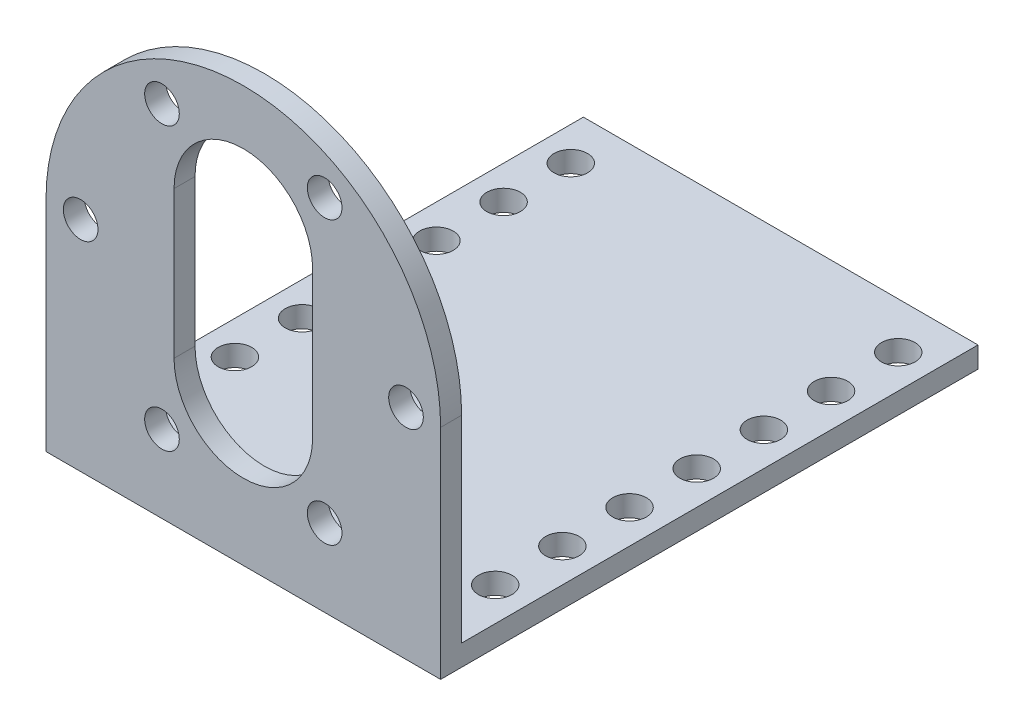
ISO-10303-21;
HEADER;
FILE_DESCRIPTION(('STEP AP214'),'2;1');
FILE_NAME('part.step','',(''),(''),'','','');
FILE_SCHEMA(('AUTOMOTIVE_DESIGN { 1 0 10303 214 1 1 1 1 }'));
ENDSEC;
DATA;
#1=APPLICATION_CONTEXT('core data for automotive mechanical design processes');
#2=APPLICATION_PROTOCOL_DEFINITION('international standard','automotive_design',2000,#1);
#3=PRODUCT_CONTEXT('',#1,'mechanical');
#4=PRODUCT('Part','Part','',(#3));
#5=PRODUCT_RELATED_PRODUCT_CATEGORY('part','',(#4));
#6=PRODUCT_DEFINITION_FORMATION('','',#4);
#7=PRODUCT_DEFINITION_CONTEXT('part definition',#1,'design');
#8=PRODUCT_DEFINITION('design','',#6,#7);
#9=PRODUCT_DEFINITION_SHAPE('','',#8);
#10=(LENGTH_UNIT() NAMED_UNIT(*) SI_UNIT(.MILLI.,.METRE.));
#11=(NAMED_UNIT(*) PLANE_ANGLE_UNIT() SI_UNIT($,.RADIAN.));
#12=(NAMED_UNIT(*) SI_UNIT($,.STERADIAN.) SOLID_ANGLE_UNIT());
#13=UNCERTAINTY_MEASURE_WITH_UNIT(LENGTH_MEASURE(1.E-05),#10,'distance_accuracy_value','');
#14=(GEOMETRIC_REPRESENTATION_CONTEXT(3) GLOBAL_UNCERTAINTY_ASSIGNED_CONTEXT((#13)) GLOBAL_UNIT_ASSIGNED_CONTEXT((#10,
#11,#12)) REPRESENTATION_CONTEXT('',''));
#15=CARTESIAN_POINT('',(0.,0.,0.));
#16=DIRECTION('',(0.,0.,1.));
#17=DIRECTION('',(1.,0.,0.));
#18=AXIS2_PLACEMENT_3D('',#15,#16,#17);
#19=CARTESIAN_POINT('',(-6.6,7.00000010430813,0.));
#20=DIRECTION('',(-1.,0.,0.));
#21=DIRECTION('',(0.,0.,1.));
#22=AXIS2_PLACEMENT_3D('',#19,#20,#21);
#23=PLANE('',#22);
#24=DIRECTION('',(0.,0.,1.));
#25=VECTOR('',#24,1.);
#26=CARTESIAN_POINT('',(-6.6,-7.00000010430813,0.));
#27=LINE('',#26,#25);
#28=CARTESIAN_POINT('',(-6.6,-7.00000010430813,2.));
#29=VERTEX_POINT('',#28);
#30=CARTESIAN_POINT('',(-6.6,-7.00000010430813,0.));
#31=VERTEX_POINT('',#30);
#32=EDGE_CURVE('E109',#29,#31,#27,.F.);
#33=ORIENTED_EDGE('',*,*,#32,.T.);
#34=DIRECTION('',(0.,1.,0.));
#35=VECTOR('',#34,1.);
#36=CARTESIAN_POINT('',(-6.6,-1.,0.));
#37=LINE('',#36,#35);
#38=CARTESIAN_POINT('',(-6.6,7.00000010430813,0.));
#39=VERTEX_POINT('',#38);
#40=EDGE_CURVE('E117',#31,#39,#37,.T.);
#41=ORIENTED_EDGE('',*,*,#40,.T.);
#42=DIRECTION('',(0.,0.,1.));
#43=VECTOR('',#42,1.);
#44=CARTESIAN_POINT('',(-6.6,7.00000010430813,0.));
#45=LINE('',#44,#43);
#46=CARTESIAN_POINT('',(-6.6,7.00000010430813,2.));
#47=VERTEX_POINT('',#46);
#48=EDGE_CURVE('E91',#39,#47,#45,.T.);
#49=ORIENTED_EDGE('',*,*,#48,.T.);
#50=DIRECTION('',(0.,1.,0.));
#51=VECTOR('',#50,1.);
#52=CARTESIAN_POINT('',(-6.6,-1.,2.));
#53=LINE('',#52,#51);
#54=EDGE_CURVE('E265',#29,#47,#53,.T.);
#55=ORIENTED_EDGE('',*,*,#54,.F.);
#56=EDGE_LOOP('',(#33,#41,#49,#55));
#57=FACE_BOUND('',#56,.T.);
#58=ADVANCED_FACE('F17',(#57),#23,.F.);
#59=CARTESIAN_POINT('',(0.,7.00000010430813,0.));
#60=DIRECTION('',(0.,0.,1.));
#61=DIRECTION('',(1.,0.,0.));
#62=AXIS2_PLACEMENT_3D('',#59,#60,#61);
#63=CYLINDRICAL_SURFACE('',#62,6.6);
#64=ORIENTED_EDGE('',*,*,#48,.F.);
#65=CARTESIAN_POINT('',(0.,7.00000010430813,0.));
#66=DIRECTION('',(0.,0.,1.));
#67=DIRECTION('',(1.,0.,0.));
#68=AXIS2_PLACEMENT_3D('',#65,#66,#67);
#69=CIRCLE('',#68,6.6);
#70=CARTESIAN_POINT('',(6.6,7.00000010430813,0.));
#71=VERTEX_POINT('',#70);
#72=EDGE_CURVE('E20',#39,#71,#69,.F.);
#73=ORIENTED_EDGE('',*,*,#72,.T.);
#74=DIRECTION('',(0.,0.,-1.));
#75=VECTOR('',#74,1.);
#76=CARTESIAN_POINT('',(6.6,7.00000010430813,0.));
#77=LINE('',#76,#75);
#78=CARTESIAN_POINT('',(6.6,7.00000010430813,2.));
#79=VERTEX_POINT('',#78);
#80=EDGE_CURVE('E96',#71,#79,#77,.F.);
#81=ORIENTED_EDGE('',*,*,#80,.T.);
#82=CARTESIAN_POINT('',(0.,7.00000010430813,2.));
#83=DIRECTION('',(0.,0.,1.));
#84=DIRECTION('',(1.,0.,0.));
#85=AXIS2_PLACEMENT_3D('',#82,#83,#84);
#86=CIRCLE('',#85,6.6);
#87=EDGE_CURVE('E263',#47,#79,#86,.F.);
#88=ORIENTED_EDGE('',*,*,#87,.F.);
#89=EDGE_LOOP('',(#64,#73,#81,#88));
#90=FACE_BOUND('',#89,.T.);
#91=ADVANCED_FACE('F95',(#90),#63,.F.);
#92=CARTESIAN_POINT('',(6.6,-7.00000010430813,0.));
#93=DIRECTION('',(1.,0.,0.));
#94=DIRECTION('',(0.,0.,-1.));
#95=AXIS2_PLACEMENT_3D('',#92,#93,#94);
#96=PLANE('',#95);
#97=ORIENTED_EDGE('',*,*,#80,.F.);
#98=DIRECTION('',(0.,1.,0.));
#99=VECTOR('',#98,1.);
#100=CARTESIAN_POINT('',(6.6,-1.,0.));
#101=LINE('',#100,#99);
#102=CARTESIAN_POINT('',(6.6,-7.00000010430813,0.));
#103=VERTEX_POINT('',#102);
#104=EDGE_CURVE('E101',#71,#103,#101,.F.);
#105=ORIENTED_EDGE('',*,*,#104,.T.);
#106=DIRECTION('',(0.,0.,1.));
#107=VECTOR('',#106,1.);
#108=CARTESIAN_POINT('',(6.6,-7.00000010430813,0.));
#109=LINE('',#108,#107);
#110=CARTESIAN_POINT('',(6.6,-7.00000010430813,2.));
#111=VERTEX_POINT('',#110);
#112=EDGE_CURVE('E102',#103,#111,#109,.T.);
#113=ORIENTED_EDGE('',*,*,#112,.T.);
#114=DIRECTION('',(0.,1.,0.));
#115=VECTOR('',#114,1.);
#116=CARTESIAN_POINT('',(6.6,-1.,2.));
#117=LINE('',#116,#115);
#118=EDGE_CURVE('E107',#79,#111,#117,.F.);
#119=ORIENTED_EDGE('',*,*,#118,.F.);
#120=EDGE_LOOP('',(#97,#105,#113,#119));
#121=FACE_BOUND('',#120,.T.);
#122=ADVANCED_FACE('F104',(#121),#96,.F.);
#123=CARTESIAN_POINT('',(0.,-7.00000010430813,0.));
#124=DIRECTION('',(0.,0.,1.));
#125=DIRECTION('',(1.,0.,0.));
#126=AXIS2_PLACEMENT_3D('',#123,#124,#125);
#127=CYLINDRICAL_SURFACE('',#126,6.6);
#128=ORIENTED_EDGE('',*,*,#112,.F.);
#129=CARTESIAN_POINT('',(0.,-7.00000010430813,0.));
#130=DIRECTION('',(0.,0.,1.));
#131=DIRECTION('',(1.,0.,0.));
#132=AXIS2_PLACEMENT_3D('',#129,#130,#131);
#133=CIRCLE('',#132,6.6);
#134=EDGE_CURVE('E115',#103,#31,#133,.F.);
#135=ORIENTED_EDGE('',*,*,#134,.T.);
#136=ORIENTED_EDGE('',*,*,#32,.F.);
#137=CARTESIAN_POINT('',(0.,-7.00000010430813,2.));
#138=DIRECTION('',(0.,0.,1.));
#139=DIRECTION('',(1.,0.,0.));
#140=AXIS2_PLACEMENT_3D('',#137,#138,#139);
#141=CIRCLE('',#140,6.6);
#142=EDGE_CURVE('E260',#111,#29,#141,.F.);
#143=ORIENTED_EDGE('',*,*,#142,.F.);
#144=EDGE_LOOP('',(#128,#135,#136,#143));
#145=FACE_BOUND('',#144,.T.);
#146=ADVANCED_FACE('F294',(#145),#127,.F.);
#147=CARTESIAN_POINT('',(7.75,13.4233937586588,0.));
#148=DIRECTION('',(0.,0.,1.));
#149=DIRECTION('',(1.,0.,0.));
#150=AXIS2_PLACEMENT_3D('',#147,#148,#149);
#151=CYLINDRICAL_SURFACE('',#150,1.65);
#152=CARTESIAN_POINT('',(7.75,13.4233937586588,0.));
#153=DIRECTION('',(0.,0.,1.));
#154=DIRECTION('',(1.,0.,0.));
#155=AXIS2_PLACEMENT_3D('',#152,#153,#154);
#156=CIRCLE('',#155,1.65);
#157=CARTESIAN_POINT('',(9.4,13.4233937586588,0.));
#158=VERTEX_POINT('',#157);
#159=EDGE_CURVE('E270',#158,#158,#156,.F.);
#160=ORIENTED_EDGE('',*,*,#159,.T.);
#161=EDGE_LOOP('',(#160));
#162=FACE_BOUND('',#161,.T.);
#163=CARTESIAN_POINT('',(7.75,13.4233937586588,2.));
#164=DIRECTION('',(0.,0.,1.));
#165=DIRECTION('',(1.,0.,0.));
#166=AXIS2_PLACEMENT_3D('',#163,#164,#165);
#167=CIRCLE('',#166,1.65);
#168=CARTESIAN_POINT('',(9.4,13.4233937586588,2.));
#169=VERTEX_POINT('',#168);
#170=EDGE_CURVE('E257',#169,#169,#167,.F.);
#171=ORIENTED_EDGE('',*,*,#170,.F.);
#172=EDGE_LOOP('',(#171));
#173=FACE_BOUND('',#172,.T.);
#174=ADVANCED_FACE('F454',(#162,#173),#151,.F.);
#175=CARTESIAN_POINT('',(15.5,0.,0.));
#176=DIRECTION('',(0.,0.,1.));
#177=DIRECTION('',(1.,0.,0.));
#178=AXIS2_PLACEMENT_3D('',#175,#176,#177);
#179=CYLINDRICAL_SURFACE('',#178,1.65);
#180=CARTESIAN_POINT('',(15.5,0.,0.));
#181=DIRECTION('',(0.,0.,1.));
#182=DIRECTION('',(1.,0.,0.));
#183=AXIS2_PLACEMENT_3D('',#180,#181,#182);
#184=CIRCLE('',#183,1.65);
#185=CARTESIAN_POINT('',(17.15,0.,0.));
#186=VERTEX_POINT('',#185);
#187=EDGE_CURVE('E273',#186,#186,#184,.F.);
#188=ORIENTED_EDGE('',*,*,#187,.T.);
#189=EDGE_LOOP('',(#188));
#190=FACE_BOUND('',#189,.T.);
#191=CARTESIAN_POINT('',(15.5,0.,2.));
#192=DIRECTION('',(0.,0.,1.));
#193=DIRECTION('',(1.,0.,0.));
#194=AXIS2_PLACEMENT_3D('',#191,#192,#193);
#195=CIRCLE('',#194,1.65);
#196=CARTESIAN_POINT('',(17.15,0.,2.));
#197=VERTEX_POINT('',#196);
#198=EDGE_CURVE('E254',#197,#197,#195,.F.);
#199=ORIENTED_EDGE('',*,*,#198,.F.);
#200=EDGE_LOOP('',(#199));
#201=FACE_BOUND('',#200,.T.);
#202=ADVANCED_FACE('F450',(#190,#201),#179,.F.);
#203=CARTESIAN_POINT('',(-7.75,-13.4233937586588,0.));
#204=DIRECTION('',(0.,0.,1.));
#205=DIRECTION('',(1.,0.,0.));
#206=AXIS2_PLACEMENT_3D('',#203,#204,#205);
#207=CYLINDRICAL_SURFACE('',#206,1.65);
#208=CARTESIAN_POINT('',(-7.75,-13.4233937586588,0.));
#209=DIRECTION('',(0.,0.,1.));
#210=DIRECTION('',(1.,0.,0.));
#211=AXIS2_PLACEMENT_3D('',#208,#209,#210);
#212=CIRCLE('',#211,1.65);
#213=CARTESIAN_POINT('',(-6.1,-13.4233937586588,0.));
#214=VERTEX_POINT('',#213);
#215=EDGE_CURVE('E276',#214,#214,#212,.F.);
#216=ORIENTED_EDGE('',*,*,#215,.T.);
#217=EDGE_LOOP('',(#216));
#218=FACE_BOUND('',#217,.T.);
#219=CARTESIAN_POINT('',(-7.75,-13.4233937586588,2.));
#220=DIRECTION('',(0.,0.,1.));
#221=DIRECTION('',(1.,0.,0.));
#222=AXIS2_PLACEMENT_3D('',#219,#220,#221);
#223=CIRCLE('',#222,1.65);
#224=CARTESIAN_POINT('',(-6.1,-13.4233937586588,2.));
#225=VERTEX_POINT('',#224);
#226=EDGE_CURVE('E251',#225,#225,#223,.F.);
#227=ORIENTED_EDGE('',*,*,#226,.F.);
#228=EDGE_LOOP('',(#227));
#229=FACE_BOUND('',#228,.T.);
#230=ADVANCED_FACE('F446',(#218,#229),#207,.F.);
#231=CARTESIAN_POINT('',(-7.75,13.4233937586588,0.));
#232=DIRECTION('',(0.,0.,1.));
#233=DIRECTION('',(1.,0.,0.));
#234=AXIS2_PLACEMENT_3D('',#231,#232,#233);
#235=CYLINDRICAL_SURFACE('',#234,1.65);
#236=CARTESIAN_POINT('',(-7.75,13.4233937586588,0.));
#237=DIRECTION('',(0.,0.,1.));
#238=DIRECTION('',(1.,0.,0.));
#239=AXIS2_PLACEMENT_3D('',#236,#237,#238);
#240=CIRCLE('',#239,1.65);
#241=CARTESIAN_POINT('',(-6.1,13.4233937586588,0.));
#242=VERTEX_POINT('',#241);
#243=EDGE_CURVE('E279',#242,#242,#240,.F.);
#244=ORIENTED_EDGE('',*,*,#243,.T.);
#245=EDGE_LOOP('',(#244));
#246=FACE_BOUND('',#245,.T.);
#247=CARTESIAN_POINT('',(-7.75,13.4233937586588,2.));
#248=DIRECTION('',(0.,0.,1.));
#249=DIRECTION('',(1.,0.,0.));
#250=AXIS2_PLACEMENT_3D('',#247,#248,#249);
#251=CIRCLE('',#250,1.65);
#252=CARTESIAN_POINT('',(-6.1,13.4233937586588,2.));
#253=VERTEX_POINT('',#252);
#254=EDGE_CURVE('E248',#253,#253,#251,.F.);
#255=ORIENTED_EDGE('',*,*,#254,.F.);
#256=EDGE_LOOP('',(#255));
#257=FACE_BOUND('',#256,.T.);
#258=ADVANCED_FACE('F442',(#246,#257),#235,.F.);
#259=CARTESIAN_POINT('',(-15.5,0.,0.));
#260=DIRECTION('',(0.,0.,1.));
#261=DIRECTION('',(1.,0.,0.));
#262=AXIS2_PLACEMENT_3D('',#259,#260,#261);
#263=CYLINDRICAL_SURFACE('',#262,1.65);
#264=CARTESIAN_POINT('',(-15.5,0.,0.));
#265=DIRECTION('',(0.,0.,1.));
#266=DIRECTION('',(1.,0.,0.));
#267=AXIS2_PLACEMENT_3D('',#264,#265,#266);
#268=CIRCLE('',#267,1.65);
#269=CARTESIAN_POINT('',(-13.85,0.,0.));
#270=VERTEX_POINT('',#269);
#271=EDGE_CURVE('E282',#270,#270,#268,.F.);
#272=ORIENTED_EDGE('',*,*,#271,.T.);
#273=EDGE_LOOP('',(#272));
#274=FACE_BOUND('',#273,.T.);
#275=CARTESIAN_POINT('',(-15.5,0.,2.));
#276=DIRECTION('',(0.,0.,1.));
#277=DIRECTION('',(1.,0.,0.));
#278=AXIS2_PLACEMENT_3D('',#275,#276,#277);
#279=CIRCLE('',#278,1.65);
#280=CARTESIAN_POINT('',(-13.85,0.,2.));
#281=VERTEX_POINT('',#280);
#282=EDGE_CURVE('E245',#281,#281,#279,.F.);
#283=ORIENTED_EDGE('',*,*,#282,.F.);
#284=EDGE_LOOP('',(#283));
#285=FACE_BOUND('',#284,.T.);
#286=ADVANCED_FACE('F435',(#274,#285),#263,.F.);
#287=CARTESIAN_POINT('',(7.74999999999999,-13.4233937586588,0.));
#288=DIRECTION('',(0.,0.,1.));
#289=DIRECTION('',(1.,0.,0.));
#290=AXIS2_PLACEMENT_3D('',#287,#288,#289);
#291=CYLINDRICAL_SURFACE('',#290,1.65);
#292=CARTESIAN_POINT('',(7.74999999999999,-13.4233937586588,0.));
#293=DIRECTION('',(0.,0.,1.));
#294=DIRECTION('',(1.,0.,0.));
#295=AXIS2_PLACEMENT_3D('',#292,#293,#294);
#296=CIRCLE('',#295,1.65);
#297=CARTESIAN_POINT('',(9.39999999999999,-13.4233937586588,0.));
#298=VERTEX_POINT('',#297);
#299=EDGE_CURVE('E285',#298,#298,#296,.F.);
#300=ORIENTED_EDGE('',*,*,#299,.T.);
#301=EDGE_LOOP('',(#300));
#302=FACE_BOUND('',#301,.T.);
#303=CARTESIAN_POINT('',(7.74999999999999,-13.4233937586588,2.));
#304=DIRECTION('',(0.,0.,1.));
#305=DIRECTION('',(1.,0.,0.));
#306=AXIS2_PLACEMENT_3D('',#303,#304,#305);
#307=CIRCLE('',#306,1.65);
#308=CARTESIAN_POINT('',(9.39999999999999,-13.4233937586588,2.));
#309=VERTEX_POINT('',#308);
#310=EDGE_CURVE('E125',#309,#309,#307,.F.);
#311=ORIENTED_EDGE('',*,*,#310,.F.);
#312=EDGE_LOOP('',(#311));
#313=FACE_BOUND('',#312,.T.);
#314=ADVANCED_FACE('F427',(#302,#313),#291,.F.);
#315=CARTESIAN_POINT('',(0.,-1.,0.));
#316=DIRECTION('',(0.,0.,1.));
#317=DIRECTION('',(1.,0.,0.));
#318=AXIS2_PLACEMENT_3D('',#315,#316,#317);
#319=PLANE('',#318);
#320=ORIENTED_EDGE('',*,*,#159,.F.);
#321=EDGE_LOOP('',(#320));
#322=FACE_BOUND('',#321,.T.);
#323=ORIENTED_EDGE('',*,*,#187,.F.);
#324=EDGE_LOOP('',(#323));
#325=FACE_BOUND('',#324,.T.);
#326=ORIENTED_EDGE('',*,*,#215,.F.);
#327=EDGE_LOOP('',(#326));
#328=FACE_BOUND('',#327,.T.);
#329=ORIENTED_EDGE('',*,*,#243,.F.);
#330=EDGE_LOOP('',(#329));
#331=FACE_BOUND('',#330,.T.);
#332=ORIENTED_EDGE('',*,*,#271,.F.);
#333=EDGE_LOOP('',(#332));
#334=FACE_BOUND('',#333,.T.);
#335=ORIENTED_EDGE('',*,*,#299,.F.);
#336=EDGE_LOOP('',(#335));
#337=FACE_BOUND('',#336,.T.);
#338=ORIENTED_EDGE('',*,*,#134,.F.);
#339=ORIENTED_EDGE('',*,*,#104,.F.);
#340=ORIENTED_EDGE('',*,*,#72,.F.);
#341=ORIENTED_EDGE('',*,*,#40,.F.);
#342=EDGE_LOOP('',(#338,#339,#340,#341));
#343=FACE_BOUND('',#342,.T.);
#344=DIRECTION('',(0.,1.,0.));
#345=VECTOR('',#344,1.);
#346=CARTESIAN_POINT('',(-18.8,0.,0.));
#347=LINE('',#346,#345);
#348=CARTESIAN_POINT('',(-18.8,0.,0.));
#349=VERTEX_POINT('',#348);
#350=CARTESIAN_POINT('',(-18.8,-18.8,0.));
#351=VERTEX_POINT('',#350);
#352=EDGE_CURVE('E121',#349,#351,#347,.F.);
#353=ORIENTED_EDGE('',*,*,#352,.F.);
#354=CARTESIAN_POINT('',(0.,0.,0.));
#355=DIRECTION('',(0.,0.,1.));
#356=DIRECTION('',(1.,0.,0.));
#357=AXIS2_PLACEMENT_3D('',#354,#355,#356);
#358=CIRCLE('',#357,18.8);
#359=CARTESIAN_POINT('',(18.8,0.,0.));
#360=VERTEX_POINT('',#359);
#361=EDGE_CURVE('E136',#360,#349,#358,.T.);
#362=ORIENTED_EDGE('',*,*,#361,.F.);
#363=DIRECTION('',(0.,1.,0.));
#364=VECTOR('',#363,1.);
#365=CARTESIAN_POINT('',(18.8,-20.8,0.));
#366=LINE('',#365,#364);
#367=CARTESIAN_POINT('',(18.8,-18.8,0.));
#368=VERTEX_POINT('',#367);
#369=EDGE_CURVE('E135',#368,#360,#366,.T.);
#370=ORIENTED_EDGE('',*,*,#369,.F.);
#371=DIRECTION('',(1.,0.,0.));
#372=VECTOR('',#371,1.);
#373=CARTESIAN_POINT('',(-18.8,-18.8,0.));
#374=LINE('',#373,#372);
#375=EDGE_CURVE('E132',#351,#368,#374,.T.);
#376=ORIENTED_EDGE('',*,*,#375,.F.);
#377=EDGE_LOOP('',(#353,#362,#370,#376));
#378=FACE_BOUND('',#377,.T.);
#379=ADVANCED_FACE('F112',(#322,#325,#328,#331,#334,#337,#343,#378),#319,.F.);
#380=CARTESIAN_POINT('',(0.,0.,0.));
#381=DIRECTION('',(0.,0.,1.));
#382=DIRECTION('',(1.,0.,0.));
#383=AXIS2_PLACEMENT_3D('',#380,#381,#382);
#384=CYLINDRICAL_SURFACE('',#383,18.8);
#385=CARTESIAN_POINT('',(0.,0.,2.));
#386=DIRECTION('',(0.,0.,1.));
#387=DIRECTION('',(1.,0.,0.));
#388=AXIS2_PLACEMENT_3D('',#385,#386,#387);
#389=CIRCLE('',#388,18.8);
#390=CARTESIAN_POINT('',(18.8,0.,2.));
#391=VERTEX_POINT('',#390);
#392=CARTESIAN_POINT('',(-18.8,0.,2.));
#393=VERTEX_POINT('',#392);
#394=EDGE_CURVE('E159',#391,#393,#389,.T.);
#395=ORIENTED_EDGE('',*,*,#394,.F.);
#396=DIRECTION('',(0.,0.,-1.));
#397=VECTOR('',#396,1.);
#398=CARTESIAN_POINT('',(18.8,0.,0.));
#399=LINE('',#398,#397);
#400=EDGE_CURVE('E142',#360,#391,#399,.F.);
#401=ORIENTED_EDGE('',*,*,#400,.F.);
#402=ORIENTED_EDGE('',*,*,#361,.T.);
#403=DIRECTION('',(0.,0.,1.));
#404=VECTOR('',#403,1.);
#405=CARTESIAN_POINT('',(-18.8,0.,0.));
#406=LINE('',#405,#404);
#407=EDGE_CURVE('E307',#393,#349,#406,.F.);
#408=ORIENTED_EDGE('',*,*,#407,.F.);
#409=EDGE_LOOP('',(#395,#401,#402,#408));
#410=FACE_BOUND('',#409,.T.);
#411=ADVANCED_FACE('F412',(#410),#384,.T.);
#412=CARTESIAN_POINT('',(-18.8,-18.8,0.));
#413=DIRECTION('',(0.,1.,0.));
#414=DIRECTION('',(0.,0.,1.));
#415=AXIS2_PLACEMENT_3D('',#412,#413,#414);
#416=PLANE('',#415);
#417=CARTESIAN_POINT('',(15.6,-18.8,-6.4));
#418=DIRECTION('',(0.,1.,0.));
#419=DIRECTION('',(0.,0.,1.));
#420=AXIS2_PLACEMENT_3D('',#417,#418,#419);
#421=CIRCLE('',#420,1.6);
#422=CARTESIAN_POINT('',(15.6,-18.8,-4.8));
#423=VERTEX_POINT('',#422);
#424=EDGE_CURVE('E150',#423,#423,#421,.F.);
#425=ORIENTED_EDGE('',*,*,#424,.T.);
#426=EDGE_LOOP('',(#425));
#427=FACE_BOUND('',#426,.T.);
#428=CARTESIAN_POINT('',(15.6,-18.8,-32.));
#429=DIRECTION('',(0.,1.,0.));
#430=DIRECTION('',(0.,0.,1.));
#431=AXIS2_PLACEMENT_3D('',#428,#429,#430);
#432=CIRCLE('',#431,1.6);
#433=CARTESIAN_POINT('',(15.6,-18.8,-30.4));
#434=VERTEX_POINT('',#433);
#435=EDGE_CURVE('E203',#434,#434,#432,.F.);
#436=ORIENTED_EDGE('',*,*,#435,.T.);
#437=EDGE_LOOP('',(#436));
#438=FACE_BOUND('',#437,.T.);
#439=CARTESIAN_POINT('',(-15.6,-18.8,-38.4));
#440=DIRECTION('',(0.,1.,0.));
#441=DIRECTION('',(0.,0.,1.));
#442=AXIS2_PLACEMENT_3D('',#439,#440,#441);
#443=CIRCLE('',#442,1.6);
#444=CARTESIAN_POINT('',(-15.6,-18.8,-36.8));
#445=VERTEX_POINT('',#444);
#446=EDGE_CURVE('E206',#445,#445,#443,.F.);
#447=ORIENTED_EDGE('',*,*,#446,.T.);
#448=EDGE_LOOP('',(#447));
#449=FACE_BOUND('',#448,.T.);
#450=CARTESIAN_POINT('',(-15.6,-18.8,-12.8));
#451=DIRECTION('',(0.,1.,0.));
#452=DIRECTION('',(0.,0.,1.));
#453=AXIS2_PLACEMENT_3D('',#450,#451,#452);
#454=CIRCLE('',#453,1.6);
#455=CARTESIAN_POINT('',(-15.6,-18.8,-11.2));
#456=VERTEX_POINT('',#455);
#457=EDGE_CURVE('E209',#456,#456,#454,.F.);
#458=ORIENTED_EDGE('',*,*,#457,.T.);
#459=EDGE_LOOP('',(#458));
#460=FACE_BOUND('',#459,.T.);
#461=CARTESIAN_POINT('',(-15.6,-18.8,-19.2));
#462=DIRECTION('',(0.,1.,0.));
#463=DIRECTION('',(0.,0.,1.));
#464=AXIS2_PLACEMENT_3D('',#461,#462,#463);
#465=CIRCLE('',#464,1.6);
#466=CARTESIAN_POINT('',(-15.6,-18.8,-17.6));
#467=VERTEX_POINT('',#466);
#468=EDGE_CURVE('E212',#467,#467,#465,.F.);
#469=ORIENTED_EDGE('',*,*,#468,.T.);
#470=EDGE_LOOP('',(#469));
#471=FACE_BOUND('',#470,.T.);
#472=CARTESIAN_POINT('',(-15.6,-18.8,-44.8));
#473=DIRECTION('',(0.,1.,0.));
#474=DIRECTION('',(0.,0.,1.));
#475=AXIS2_PLACEMENT_3D('',#472,#473,#474);
#476=CIRCLE('',#475,1.6);
#477=CARTESIAN_POINT('',(-15.6,-18.8,-43.2));
#478=VERTEX_POINT('',#477);
#479=EDGE_CURVE('E215',#478,#478,#476,.F.);
#480=ORIENTED_EDGE('',*,*,#479,.T.);
#481=EDGE_LOOP('',(#480));
#482=FACE_BOUND('',#481,.T.);
#483=CARTESIAN_POINT('',(15.6,-18.8,-25.6));
#484=DIRECTION('',(0.,1.,0.));
#485=DIRECTION('',(0.,0.,1.));
#486=AXIS2_PLACEMENT_3D('',#483,#484,#485);
#487=CIRCLE('',#486,1.6);
#488=CARTESIAN_POINT('',(15.6,-18.8,-24.));
#489=VERTEX_POINT('',#488);
#490=EDGE_CURVE('E218',#489,#489,#487,.F.);
#491=ORIENTED_EDGE('',*,*,#490,.T.);
#492=EDGE_LOOP('',(#491));
#493=FACE_BOUND('',#492,.T.);
#494=CARTESIAN_POINT('',(15.6,-18.8,-12.8));
#495=DIRECTION('',(0.,1.,0.));
#496=DIRECTION('',(0.,0.,1.));
#497=AXIS2_PLACEMENT_3D('',#494,#495,#496);
#498=CIRCLE('',#497,1.6);
#499=CARTESIAN_POINT('',(15.6,-18.8,-11.2));
#500=VERTEX_POINT('',#499);
#501=EDGE_CURVE('E221',#500,#500,#498,.F.);
#502=ORIENTED_EDGE('',*,*,#501,.T.);
#503=EDGE_LOOP('',(#502));
#504=FACE_BOUND('',#503,.T.);
#505=CARTESIAN_POINT('',(15.6,-18.8,-38.4));
#506=DIRECTION('',(0.,1.,0.));
#507=DIRECTION('',(0.,0.,1.));
#508=AXIS2_PLACEMENT_3D('',#505,#506,#507);
#509=CIRCLE('',#508,1.6);
#510=CARTESIAN_POINT('',(15.6,-18.8,-36.8));
#511=VERTEX_POINT('',#510);
#512=EDGE_CURVE('E224',#511,#511,#509,.F.);
#513=ORIENTED_EDGE('',*,*,#512,.T.);
#514=EDGE_LOOP('',(#513));
#515=FACE_BOUND('',#514,.T.);
#516=CARTESIAN_POINT('',(-15.6,-18.8,-32.));
#517=DIRECTION('',(0.,1.,0.));
#518=DIRECTION('',(0.,0.,1.));
#519=AXIS2_PLACEMENT_3D('',#516,#517,#518);
#520=CIRCLE('',#519,1.6);
#521=CARTESIAN_POINT('',(-15.6,-18.8,-30.4));
#522=VERTEX_POINT('',#521);
#523=EDGE_CURVE('E227',#522,#522,#520,.F.);
#524=ORIENTED_EDGE('',*,*,#523,.T.);
#525=EDGE_LOOP('',(#524));
#526=FACE_BOUND('',#525,.T.);
#527=CARTESIAN_POINT('',(-15.6,-18.8,-6.4));
#528=DIRECTION('',(0.,1.,0.));
#529=DIRECTION('',(0.,0.,1.));
#530=AXIS2_PLACEMENT_3D('',#527,#528,#529);
#531=CIRCLE('',#530,1.6);
#532=CARTESIAN_POINT('',(-15.6,-18.8,-4.8));
#533=VERTEX_POINT('',#532);
#534=EDGE_CURVE('E230',#533,#533,#531,.F.);
#535=ORIENTED_EDGE('',*,*,#534,.T.);
#536=EDGE_LOOP('',(#535));
#537=FACE_BOUND('',#536,.T.);
#538=CARTESIAN_POINT('',(-15.6,-18.8,-25.6));
#539=DIRECTION('',(0.,1.,0.));
#540=DIRECTION('',(0.,0.,1.));
#541=AXIS2_PLACEMENT_3D('',#538,#539,#540);
#542=CIRCLE('',#541,1.6);
#543=CARTESIAN_POINT('',(-15.6,-18.8,-24.));
#544=VERTEX_POINT('',#543);
#545=EDGE_CURVE('E233',#544,#544,#542,.F.);
#546=ORIENTED_EDGE('',*,*,#545,.T.);
#547=EDGE_LOOP('',(#546));
#548=FACE_BOUND('',#547,.T.);
#549=CARTESIAN_POINT('',(15.6,-18.8,-44.8));
#550=DIRECTION('',(0.,1.,0.));
#551=DIRECTION('',(0.,0.,1.));
#552=AXIS2_PLACEMENT_3D('',#549,#550,#551);
#553=CIRCLE('',#552,1.6);
#554=CARTESIAN_POINT('',(15.6,-18.8,-43.2));
#555=VERTEX_POINT('',#554);
#556=EDGE_CURVE('E236',#555,#555,#553,.F.);
#557=ORIENTED_EDGE('',*,*,#556,.T.);
#558=EDGE_LOOP('',(#557));
#559=FACE_BOUND('',#558,.T.);
#560=CARTESIAN_POINT('',(15.6,-18.8,-19.2));
#561=DIRECTION('',(0.,1.,0.));
#562=DIRECTION('',(0.,0.,1.));
#563=AXIS2_PLACEMENT_3D('',#560,#561,#562);
#564=CIRCLE('',#563,1.6);
#565=CARTESIAN_POINT('',(15.6,-18.8,-17.6));
#566=VERTEX_POINT('',#565);
#567=EDGE_CURVE('E239',#566,#566,#564,.F.);
#568=ORIENTED_EDGE('',*,*,#567,.T.);
#569=EDGE_LOOP('',(#568));
#570=FACE_BOUND('',#569,.T.);
#571=DIRECTION('',(-1.,0.,0.));
#572=VECTOR('',#571,1.);
#573=CARTESIAN_POINT('',(0.,-18.8,-49.2));
#574=LINE('',#573,#572);
#575=CARTESIAN_POINT('',(-18.8,-18.8,-49.2));
#576=VERTEX_POINT('',#575);
#577=CARTESIAN_POINT('',(18.8,-18.8,-49.2));
#578=VERTEX_POINT('',#577);
#579=EDGE_CURVE('E418',#576,#578,#574,.F.);
#580=ORIENTED_EDGE('',*,*,#579,.F.);
#581=DIRECTION('',(0.,0.,1.));
#582=VECTOR('',#581,1.);
#583=CARTESIAN_POINT('',(-18.8,-18.8,0.));
#584=LINE('',#583,#582);
#585=EDGE_CURVE('E124',#351,#576,#584,.F.);
#586=ORIENTED_EDGE('',*,*,#585,.F.);
#587=ORIENTED_EDGE('',*,*,#375,.T.);
#588=DIRECTION('',(0.,0.,-1.));
#589=VECTOR('',#588,1.);
#590=CARTESIAN_POINT('',(18.8,-18.8,0.));
#591=LINE('',#590,#589);
#592=EDGE_CURVE('E145',#578,#368,#591,.F.);
#593=ORIENTED_EDGE('',*,*,#592,.F.);
#594=EDGE_LOOP('',(#580,#586,#587,#593));
#595=FACE_BOUND('',#594,.T.);
#596=ADVANCED_FACE('F409',(#427,#438,#449,#460,#471,#482,#493,#504,#515,#526,#537,#548,#559,
#570,#595),#416,.T.);
#597=CARTESIAN_POINT('',(18.8,-20.8,0.));
#598=DIRECTION('',(1.,0.,0.));
#599=DIRECTION('',(0.,0.,-1.));
#600=AXIS2_PLACEMENT_3D('',#597,#598,#599);
#601=PLANE('',#600);
#602=DIRECTION('',(0.,1.,0.));
#603=VECTOR('',#602,1.);
#604=CARTESIAN_POINT('',(18.8,-19.8,-49.2));
#605=LINE('',#604,#603);
#606=CARTESIAN_POINT('',(18.8,-20.8,-49.2));
#607=VERTEX_POINT('',#606);
#608=EDGE_CURVE('E242',#578,#607,#605,.F.);
#609=ORIENTED_EDGE('',*,*,#608,.F.);
#610=ORIENTED_EDGE('',*,*,#592,.T.);
#611=ORIENTED_EDGE('',*,*,#369,.T.);
#612=ORIENTED_EDGE('',*,*,#400,.T.);
#613=DIRECTION('',(0.,1.,0.));
#614=VECTOR('',#613,1.);
#615=CARTESIAN_POINT('',(18.8,-1.,2.));
#616=LINE('',#615,#614);
#617=CARTESIAN_POINT('',(18.8,-20.8,2.));
#618=VERTEX_POINT('',#617);
#619=EDGE_CURVE('E267',#618,#391,#616,.T.);
#620=ORIENTED_EDGE('',*,*,#619,.F.);
#621=DIRECTION('',(0.,0.,-1.));
#622=VECTOR('',#621,1.);
#623=CARTESIAN_POINT('',(18.8,-20.8,0.));
#624=LINE('',#623,#622);
#625=EDGE_CURVE('E146',#607,#618,#624,.F.);
#626=ORIENTED_EDGE('',*,*,#625,.F.);
#627=EDGE_LOOP('',(#609,#610,#611,#612,#620,#626));
#628=FACE_BOUND('',#627,.T.);
#629=ADVANCED_FACE('F338',(#628),#601,.T.);
#630=CARTESIAN_POINT('',(0.,-1.,2.));
#631=DIRECTION('',(0.,0.,1.));
#632=DIRECTION('',(1.,0.,0.));
#633=AXIS2_PLACEMENT_3D('',#630,#631,#632);
#634=PLANE('',#633);
#635=ORIENTED_EDGE('',*,*,#310,.T.);
#636=EDGE_LOOP('',(#635));
#637=FACE_BOUND('',#636,.T.);
#638=ORIENTED_EDGE('',*,*,#282,.T.);
#639=EDGE_LOOP('',(#638));
#640=FACE_BOUND('',#639,.T.);
#641=ORIENTED_EDGE('',*,*,#254,.T.);
#642=EDGE_LOOP('',(#641));
#643=FACE_BOUND('',#642,.T.);
#644=ORIENTED_EDGE('',*,*,#226,.T.);
#645=EDGE_LOOP('',(#644));
#646=FACE_BOUND('',#645,.T.);
#647=ORIENTED_EDGE('',*,*,#198,.T.);
#648=EDGE_LOOP('',(#647));
#649=FACE_BOUND('',#648,.T.);
#650=ORIENTED_EDGE('',*,*,#170,.T.);
#651=EDGE_LOOP('',(#650));
#652=FACE_BOUND('',#651,.T.);
#653=ORIENTED_EDGE('',*,*,#118,.T.);
#654=ORIENTED_EDGE('',*,*,#142,.T.);
#655=ORIENTED_EDGE('',*,*,#54,.T.);
#656=ORIENTED_EDGE('',*,*,#87,.T.);
#657=EDGE_LOOP('',(#653,#654,#655,#656));
#658=FACE_BOUND('',#657,.T.);
#659=DIRECTION('',(1.,0.,0.));
#660=VECTOR('',#659,1.);
#661=CARTESIAN_POINT('',(-18.8,-20.8,2.));
#662=LINE('',#661,#660);
#663=CARTESIAN_POINT('',(-18.8,-20.8,2.));
#664=VERTEX_POINT('',#663);
#665=EDGE_CURVE('E149',#618,#664,#662,.F.);
#666=ORIENTED_EDGE('',*,*,#665,.F.);
#667=ORIENTED_EDGE('',*,*,#619,.T.);
#668=ORIENTED_EDGE('',*,*,#394,.T.);
#669=DIRECTION('',(0.,1.,0.));
#670=VECTOR('',#669,1.);
#671=CARTESIAN_POINT('',(-18.8,0.,2.));
#672=LINE('',#671,#670);
#673=EDGE_CURVE('E129',#664,#393,#672,.T.);
#674=ORIENTED_EDGE('',*,*,#673,.F.);
#675=EDGE_LOOP('',(#666,#667,#668,#674));
#676=FACE_BOUND('',#675,.T.);
#677=ADVANCED_FACE('F296',(#637,#640,#643,#646,#649,#652,#658,#676),#634,.T.);
#678=CARTESIAN_POINT('',(-18.8,0.,0.));
#679=DIRECTION('',(-1.,0.,0.));
#680=DIRECTION('',(0.,0.,1.));
#681=AXIS2_PLACEMENT_3D('',#678,#679,#680);
#682=PLANE('',#681);
#683=ORIENTED_EDGE('',*,*,#673,.T.);
#684=ORIENTED_EDGE('',*,*,#407,.T.);
#685=ORIENTED_EDGE('',*,*,#352,.T.);
#686=ORIENTED_EDGE('',*,*,#585,.T.);
#687=DIRECTION('',(0.,1.,0.));
#688=VECTOR('',#687,1.);
#689=CARTESIAN_POINT('',(-18.8,-19.8,-49.2));
#690=LINE('',#689,#688);
#691=CARTESIAN_POINT('',(-18.8,-20.8,-49.2));
#692=VERTEX_POINT('',#691);
#693=EDGE_CURVE('E35',#692,#576,#690,.T.);
#694=ORIENTED_EDGE('',*,*,#693,.F.);
#695=DIRECTION('',(0.,0.,-1.));
#696=VECTOR('',#695,1.);
#697=CARTESIAN_POINT('',(-18.8,-20.8,0.));
#698=LINE('',#697,#696);
#699=EDGE_CURVE('E314',#664,#692,#698,.T.);
#700=ORIENTED_EDGE('',*,*,#699,.F.);
#701=EDGE_LOOP('',(#683,#684,#685,#686,#694,#700));
#702=FACE_BOUND('',#701,.T.);
#703=ADVANCED_FACE('F326',(#702),#682,.T.);
#704=CARTESIAN_POINT('',(0.,-19.8,-49.2));
#705=DIRECTION('',(0.,0.,-1.));
#706=DIRECTION('',(-1.,0.,0.));
#707=AXIS2_PLACEMENT_3D('',#704,#705,#706);
#708=PLANE('',#707);
#709=ORIENTED_EDGE('',*,*,#608,.T.);
#710=DIRECTION('',(1.,0.,0.));
#711=VECTOR('',#710,1.);
#712=CARTESIAN_POINT('',(-18.8,-20.8,-49.2));
#713=LINE('',#712,#711);
#714=EDGE_CURVE('E200',#692,#607,#713,.T.);
#715=ORIENTED_EDGE('',*,*,#714,.F.);
#716=ORIENTED_EDGE('',*,*,#693,.T.);
#717=ORIENTED_EDGE('',*,*,#579,.T.);
#718=EDGE_LOOP('',(#709,#715,#716,#717));
#719=FACE_BOUND('',#718,.T.);
#720=ADVANCED_FACE('F328',(#719),#708,.T.);
#721=CARTESIAN_POINT('',(15.6,-20.8,-19.2));
#722=DIRECTION('',(0.,1.,0.));
#723=DIRECTION('',(0.,0.,1.));
#724=AXIS2_PLACEMENT_3D('',#721,#722,#723);
#725=CYLINDRICAL_SURFACE('',#724,1.6);
#726=ORIENTED_EDGE('',*,*,#567,.F.);
#727=EDGE_LOOP('',(#726));
#728=FACE_BOUND('',#727,.T.);
#729=CARTESIAN_POINT('',(15.6,-20.8,-19.2));
#730=DIRECTION('',(0.,1.,0.));
#731=DIRECTION('',(0.,0.,1.));
#732=AXIS2_PLACEMENT_3D('',#729,#730,#731);
#733=CIRCLE('',#732,1.6);
#734=CARTESIAN_POINT('',(15.6,-20.8,-17.6));
#735=VERTEX_POINT('',#734);
#736=EDGE_CURVE('E197',#735,#735,#733,.T.);
#737=ORIENTED_EDGE('',*,*,#736,.F.);
#738=EDGE_LOOP('',(#737));
#739=FACE_BOUND('',#738,.T.);
#740=ADVANCED_FACE('F335',(#728,#739),#725,.F.);
#741=CARTESIAN_POINT('',(15.6,-20.8,-44.8));
#742=DIRECTION('',(0.,1.,0.));
#743=DIRECTION('',(0.,0.,1.));
#744=AXIS2_PLACEMENT_3D('',#741,#742,#743);
#745=CYLINDRICAL_SURFACE('',#744,1.6);
#746=ORIENTED_EDGE('',*,*,#556,.F.);
#747=EDGE_LOOP('',(#746));
#748=FACE_BOUND('',#747,.T.);
#749=CARTESIAN_POINT('',(15.6,-20.8,-44.8));
#750=DIRECTION('',(0.,1.,0.));
#751=DIRECTION('',(0.,0.,1.));
#752=AXIS2_PLACEMENT_3D('',#749,#750,#751);
#753=CIRCLE('',#752,1.6);
#754=CARTESIAN_POINT('',(15.6,-20.8,-43.2));
#755=VERTEX_POINT('',#754);
#756=EDGE_CURVE('E194',#755,#755,#753,.T.);
#757=ORIENTED_EDGE('',*,*,#756,.F.);
#758=EDGE_LOOP('',(#757));
#759=FACE_BOUND('',#758,.T.);
#760=ADVANCED_FACE('F395',(#748,#759),#745,.F.);
#761=CARTESIAN_POINT('',(-15.6,-20.8,-25.6));
#762=DIRECTION('',(0.,1.,0.));
#763=DIRECTION('',(0.,0.,1.));
#764=AXIS2_PLACEMENT_3D('',#761,#762,#763);
#765=CYLINDRICAL_SURFACE('',#764,1.6);
#766=ORIENTED_EDGE('',*,*,#545,.F.);
#767=EDGE_LOOP('',(#766));
#768=FACE_BOUND('',#767,.T.);
#769=CARTESIAN_POINT('',(-15.6,-20.8,-25.6));
#770=DIRECTION('',(0.,1.,0.));
#771=DIRECTION('',(0.,0.,1.));
#772=AXIS2_PLACEMENT_3D('',#769,#770,#771);
#773=CIRCLE('',#772,1.6);
#774=CARTESIAN_POINT('',(-15.6,-20.8,-24.));
#775=VERTEX_POINT('',#774);
#776=EDGE_CURVE('E191',#775,#775,#773,.T.);
#777=ORIENTED_EDGE('',*,*,#776,.F.);
#778=EDGE_LOOP('',(#777));
#779=FACE_BOUND('',#778,.T.);
#780=ADVANCED_FACE('F391',(#768,#779),#765,.F.);
#781=CARTESIAN_POINT('',(-15.6,-20.8,-6.4));
#782=DIRECTION('',(0.,1.,0.));
#783=DIRECTION('',(0.,0.,1.));
#784=AXIS2_PLACEMENT_3D('',#781,#782,#783);
#785=CYLINDRICAL_SURFACE('',#784,1.6);
#786=ORIENTED_EDGE('',*,*,#534,.F.);
#787=EDGE_LOOP('',(#786));
#788=FACE_BOUND('',#787,.T.);
#789=CARTESIAN_POINT('',(-15.6,-20.8,-6.4));
#790=DIRECTION('',(0.,1.,0.));
#791=DIRECTION('',(0.,0.,1.));
#792=AXIS2_PLACEMENT_3D('',#789,#790,#791);
#793=CIRCLE('',#792,1.6);
#794=CARTESIAN_POINT('',(-15.6,-20.8,-4.8));
#795=VERTEX_POINT('',#794);
#796=EDGE_CURVE('E188',#795,#795,#793,.T.);
#797=ORIENTED_EDGE('',*,*,#796,.F.);
#798=EDGE_LOOP('',(#797));
#799=FACE_BOUND('',#798,.T.);
#800=ADVANCED_FACE('F387',(#788,#799),#785,.F.);
#801=CARTESIAN_POINT('',(-15.6,-20.8,-32.));
#802=DIRECTION('',(0.,1.,0.));
#803=DIRECTION('',(0.,0.,1.));
#804=AXIS2_PLACEMENT_3D('',#801,#802,#803);
#805=CYLINDRICAL_SURFACE('',#804,1.6);
#806=ORIENTED_EDGE('',*,*,#523,.F.);
#807=EDGE_LOOP('',(#806));
#808=FACE_BOUND('',#807,.T.);
#809=CARTESIAN_POINT('',(-15.6,-20.8,-32.));
#810=DIRECTION('',(0.,1.,0.));
#811=DIRECTION('',(0.,0.,1.));
#812=AXIS2_PLACEMENT_3D('',#809,#810,#811);
#813=CIRCLE('',#812,1.6);
#814=CARTESIAN_POINT('',(-15.6,-20.8,-30.4));
#815=VERTEX_POINT('',#814);
#816=EDGE_CURVE('E185',#815,#815,#813,.T.);
#817=ORIENTED_EDGE('',*,*,#816,.F.);
#818=EDGE_LOOP('',(#817));
#819=FACE_BOUND('',#818,.T.);
#820=ADVANCED_FACE('F383',(#808,#819),#805,.F.);
#821=CARTESIAN_POINT('',(15.6,-20.8,-38.4));
#822=DIRECTION('',(0.,1.,0.));
#823=DIRECTION('',(0.,0.,1.));
#824=AXIS2_PLACEMENT_3D('',#821,#822,#823);
#825=CYLINDRICAL_SURFACE('',#824,1.6);
#826=ORIENTED_EDGE('',*,*,#512,.F.);
#827=EDGE_LOOP('',(#826));
#828=FACE_BOUND('',#827,.T.);
#829=CARTESIAN_POINT('',(15.6,-20.8,-38.4));
#830=DIRECTION('',(0.,1.,0.));
#831=DIRECTION('',(0.,0.,1.));
#832=AXIS2_PLACEMENT_3D('',#829,#830,#831);
#833=CIRCLE('',#832,1.6);
#834=CARTESIAN_POINT('',(15.6,-20.8,-36.8));
#835=VERTEX_POINT('',#834);
#836=EDGE_CURVE('E182',#835,#835,#833,.T.);
#837=ORIENTED_EDGE('',*,*,#836,.F.);
#838=EDGE_LOOP('',(#837));
#839=FACE_BOUND('',#838,.T.);
#840=ADVANCED_FACE('F379',(#828,#839),#825,.F.);
#841=CARTESIAN_POINT('',(15.6,-20.8,-12.8));
#842=DIRECTION('',(0.,1.,0.));
#843=DIRECTION('',(0.,0.,1.));
#844=AXIS2_PLACEMENT_3D('',#841,#842,#843);
#845=CYLINDRICAL_SURFACE('',#844,1.6);
#846=ORIENTED_EDGE('',*,*,#501,.F.);
#847=EDGE_LOOP('',(#846));
#848=FACE_BOUND('',#847,.T.);
#849=CARTESIAN_POINT('',(15.6,-20.8,-12.8));
#850=DIRECTION('',(0.,1.,0.));
#851=DIRECTION('',(0.,0.,1.));
#852=AXIS2_PLACEMENT_3D('',#849,#850,#851);
#853=CIRCLE('',#852,1.6);
#854=CARTESIAN_POINT('',(15.6,-20.8,-11.2));
#855=VERTEX_POINT('',#854);
#856=EDGE_CURVE('E179',#855,#855,#853,.T.);
#857=ORIENTED_EDGE('',*,*,#856,.F.);
#858=EDGE_LOOP('',(#857));
#859=FACE_BOUND('',#858,.T.);
#860=ADVANCED_FACE('F375',(#848,#859),#845,.F.);
#861=CARTESIAN_POINT('',(15.6,-20.8,-25.6));
#862=DIRECTION('',(0.,1.,0.));
#863=DIRECTION('',(0.,0.,1.));
#864=AXIS2_PLACEMENT_3D('',#861,#862,#863);
#865=CYLINDRICAL_SURFACE('',#864,1.6);
#866=ORIENTED_EDGE('',*,*,#490,.F.);
#867=EDGE_LOOP('',(#866));
#868=FACE_BOUND('',#867,.T.);
#869=CARTESIAN_POINT('',(15.6,-20.8,-25.6));
#870=DIRECTION('',(0.,1.,0.));
#871=DIRECTION('',(0.,0.,1.));
#872=AXIS2_PLACEMENT_3D('',#869,#870,#871);
#873=CIRCLE('',#872,1.6);
#874=CARTESIAN_POINT('',(15.6,-20.8,-24.));
#875=VERTEX_POINT('',#874);
#876=EDGE_CURVE('E176',#875,#875,#873,.T.);
#877=ORIENTED_EDGE('',*,*,#876,.F.);
#878=EDGE_LOOP('',(#877));
#879=FACE_BOUND('',#878,.T.);
#880=ADVANCED_FACE('F371',(#868,#879),#865,.F.);
#881=CARTESIAN_POINT('',(-15.6,-20.8,-44.8));
#882=DIRECTION('',(0.,1.,0.));
#883=DIRECTION('',(0.,0.,1.));
#884=AXIS2_PLACEMENT_3D('',#881,#882,#883);
#885=CYLINDRICAL_SURFACE('',#884,1.6);
#886=ORIENTED_EDGE('',*,*,#479,.F.);
#887=EDGE_LOOP('',(#886));
#888=FACE_BOUND('',#887,.T.);
#889=CARTESIAN_POINT('',(-15.6,-20.8,-44.8));
#890=DIRECTION('',(0.,1.,0.));
#891=DIRECTION('',(0.,0.,1.));
#892=AXIS2_PLACEMENT_3D('',#889,#890,#891);
#893=CIRCLE('',#892,1.6);
#894=CARTESIAN_POINT('',(-15.6,-20.8,-43.2));
#895=VERTEX_POINT('',#894);
#896=EDGE_CURVE('E173',#895,#895,#893,.T.);
#897=ORIENTED_EDGE('',*,*,#896,.F.);
#898=EDGE_LOOP('',(#897));
#899=FACE_BOUND('',#898,.T.);
#900=ADVANCED_FACE('F367',(#888,#899),#885,.F.);
#901=CARTESIAN_POINT('',(-15.6,-20.8,-19.2));
#902=DIRECTION('',(0.,1.,0.));
#903=DIRECTION('',(0.,0.,1.));
#904=AXIS2_PLACEMENT_3D('',#901,#902,#903);
#905=CYLINDRICAL_SURFACE('',#904,1.6);
#906=ORIENTED_EDGE('',*,*,#468,.F.);
#907=EDGE_LOOP('',(#906));
#908=FACE_BOUND('',#907,.T.);
#909=CARTESIAN_POINT('',(-15.6,-20.8,-19.2));
#910=DIRECTION('',(0.,1.,0.));
#911=DIRECTION('',(0.,0.,1.));
#912=AXIS2_PLACEMENT_3D('',#909,#910,#911);
#913=CIRCLE('',#912,1.6);
#914=CARTESIAN_POINT('',(-15.6,-20.8,-17.6));
#915=VERTEX_POINT('',#914);
#916=EDGE_CURVE('E170',#915,#915,#913,.T.);
#917=ORIENTED_EDGE('',*,*,#916,.F.);
#918=EDGE_LOOP('',(#917));
#919=FACE_BOUND('',#918,.T.);
#920=ADVANCED_FACE('F363',(#908,#919),#905,.F.);
#921=CARTESIAN_POINT('',(-15.6,-20.8,-12.8));
#922=DIRECTION('',(0.,1.,0.));
#923=DIRECTION('',(0.,0.,1.));
#924=AXIS2_PLACEMENT_3D('',#921,#922,#923);
#925=CYLINDRICAL_SURFACE('',#924,1.6);
#926=ORIENTED_EDGE('',*,*,#457,.F.);
#927=EDGE_LOOP('',(#926));
#928=FACE_BOUND('',#927,.T.);
#929=CARTESIAN_POINT('',(-15.6,-20.8,-12.8));
#930=DIRECTION('',(0.,1.,0.));
#931=DIRECTION('',(0.,0.,1.));
#932=AXIS2_PLACEMENT_3D('',#929,#930,#931);
#933=CIRCLE('',#932,1.6);
#934=CARTESIAN_POINT('',(-15.6,-20.8,-11.2));
#935=VERTEX_POINT('',#934);
#936=EDGE_CURVE('E167',#935,#935,#933,.T.);
#937=ORIENTED_EDGE('',*,*,#936,.F.);
#938=EDGE_LOOP('',(#937));
#939=FACE_BOUND('',#938,.T.);
#940=ADVANCED_FACE('F359',(#928,#939),#925,.F.);
#941=CARTESIAN_POINT('',(-15.6,-20.8,-38.4));
#942=DIRECTION('',(0.,1.,0.));
#943=DIRECTION('',(0.,0.,1.));
#944=AXIS2_PLACEMENT_3D('',#941,#942,#943);
#945=CYLINDRICAL_SURFACE('',#944,1.6);
#946=ORIENTED_EDGE('',*,*,#446,.F.);
#947=EDGE_LOOP('',(#946));
#948=FACE_BOUND('',#947,.T.);
#949=CARTESIAN_POINT('',(-15.6,-20.8,-38.4));
#950=DIRECTION('',(0.,1.,0.));
#951=DIRECTION('',(0.,0.,1.));
#952=AXIS2_PLACEMENT_3D('',#949,#950,#951);
#953=CIRCLE('',#952,1.6);
#954=CARTESIAN_POINT('',(-15.6,-20.8,-36.8));
#955=VERTEX_POINT('',#954);
#956=EDGE_CURVE('E164',#955,#955,#953,.T.);
#957=ORIENTED_EDGE('',*,*,#956,.F.);
#958=EDGE_LOOP('',(#957));
#959=FACE_BOUND('',#958,.T.);
#960=ADVANCED_FACE('F355',(#948,#959),#945,.F.);
#961=CARTESIAN_POINT('',(15.6,-20.8,-32.));
#962=DIRECTION('',(0.,1.,0.));
#963=DIRECTION('',(0.,0.,1.));
#964=AXIS2_PLACEMENT_3D('',#961,#962,#963);
#965=CYLINDRICAL_SURFACE('',#964,1.6);
#966=ORIENTED_EDGE('',*,*,#435,.F.);
#967=EDGE_LOOP('',(#966));
#968=FACE_BOUND('',#967,.T.);
#969=CARTESIAN_POINT('',(15.6,-20.8,-32.));
#970=DIRECTION('',(0.,1.,0.));
#971=DIRECTION('',(0.,0.,1.));
#972=AXIS2_PLACEMENT_3D('',#969,#970,#971);
#973=CIRCLE('',#972,1.6);
#974=CARTESIAN_POINT('',(15.6,-20.8,-30.4));
#975=VERTEX_POINT('',#974);
#976=EDGE_CURVE('E26',#975,#975,#973,.T.);
#977=ORIENTED_EDGE('',*,*,#976,.F.);
#978=EDGE_LOOP('',(#977));
#979=FACE_BOUND('',#978,.T.);
#980=ADVANCED_FACE('F348',(#968,#979),#965,.F.);
#981=CARTESIAN_POINT('',(15.6,-20.8,-6.4));
#982=DIRECTION('',(0.,1.,0.));
#983=DIRECTION('',(0.,0.,1.));
#984=AXIS2_PLACEMENT_3D('',#981,#982,#983);
#985=CYLINDRICAL_SURFACE('',#984,1.6);
#986=ORIENTED_EDGE('',*,*,#424,.F.);
#987=EDGE_LOOP('',(#986));
#988=FACE_BOUND('',#987,.T.);
#989=CARTESIAN_POINT('',(15.6,-20.8,-6.4));
#990=DIRECTION('',(0.,1.,0.));
#991=DIRECTION('',(0.,0.,1.));
#992=AXIS2_PLACEMENT_3D('',#989,#990,#991);
#993=CIRCLE('',#992,1.6);
#994=CARTESIAN_POINT('',(15.6,-20.8,-4.8));
#995=VERTEX_POINT('',#994);
#996=EDGE_CURVE('E11',#995,#995,#993,.T.);
#997=ORIENTED_EDGE('',*,*,#996,.F.);
#998=EDGE_LOOP('',(#997));
#999=FACE_BOUND('',#998,.T.);
#1000=ADVANCED_FACE('F342',(#988,#999),#985,.F.);
#1001=CARTESIAN_POINT('',(-18.8,-20.8,0.));
#1002=DIRECTION('',(0.,-1.,0.));
#1003=DIRECTION('',(0.,0.,-1.));
#1004=AXIS2_PLACEMENT_3D('',#1001,#1002,#1003);
#1005=PLANE('',#1004);
#1006=ORIENTED_EDGE('',*,*,#996,.T.);
#1007=EDGE_LOOP('',(#1006));
#1008=FACE_BOUND('',#1007,.T.);
#1009=ORIENTED_EDGE('',*,*,#976,.T.);
#1010=EDGE_LOOP('',(#1009));
#1011=FACE_BOUND('',#1010,.T.);
#1012=ORIENTED_EDGE('',*,*,#956,.T.);
#1013=EDGE_LOOP('',(#1012));
#1014=FACE_BOUND('',#1013,.T.);
#1015=ORIENTED_EDGE('',*,*,#936,.T.);
#1016=EDGE_LOOP('',(#1015));
#1017=FACE_BOUND('',#1016,.T.);
#1018=ORIENTED_EDGE('',*,*,#916,.T.);
#1019=EDGE_LOOP('',(#1018));
#1020=FACE_BOUND('',#1019,.T.);
#1021=ORIENTED_EDGE('',*,*,#896,.T.);
#1022=EDGE_LOOP('',(#1021));
#1023=FACE_BOUND('',#1022,.T.);
#1024=ORIENTED_EDGE('',*,*,#876,.T.);
#1025=EDGE_LOOP('',(#1024));
#1026=FACE_BOUND('',#1025,.T.);
#1027=ORIENTED_EDGE('',*,*,#856,.T.);
#1028=EDGE_LOOP('',(#1027));
#1029=FACE_BOUND('',#1028,.T.);
#1030=ORIENTED_EDGE('',*,*,#836,.T.);
#1031=EDGE_LOOP('',(#1030));
#1032=FACE_BOUND('',#1031,.T.);
#1033=ORIENTED_EDGE('',*,*,#816,.T.);
#1034=EDGE_LOOP('',(#1033));
#1035=FACE_BOUND('',#1034,.T.);
#1036=ORIENTED_EDGE('',*,*,#796,.T.);
#1037=EDGE_LOOP('',(#1036));
#1038=FACE_BOUND('',#1037,.T.);
#1039=ORIENTED_EDGE('',*,*,#776,.T.);
#1040=EDGE_LOOP('',(#1039));
#1041=FACE_BOUND('',#1040,.T.);
#1042=ORIENTED_EDGE('',*,*,#756,.T.);
#1043=EDGE_LOOP('',(#1042));
#1044=FACE_BOUND('',#1043,.T.);
#1045=ORIENTED_EDGE('',*,*,#736,.T.);
#1046=EDGE_LOOP('',(#1045));
#1047=FACE_BOUND('',#1046,.T.);
#1048=ORIENTED_EDGE('',*,*,#699,.T.);
#1049=ORIENTED_EDGE('',*,*,#714,.T.);
#1050=ORIENTED_EDGE('',*,*,#625,.T.);
#1051=ORIENTED_EDGE('',*,*,#665,.T.);
#1052=EDGE_LOOP('',(#1048,#1049,#1050,#1051));
#1053=FACE_BOUND('',#1052,.T.);
#1054=ADVANCED_FACE('F323',(#1008,#1011,#1014,#1017,#1020,#1023,#1026,#1029,#1032,#1035,#1038,
#1041,#1044,#1047,#1053),#1005,.T.);
#1055=CLOSED_SHELL('',(#58,#91,#122,#146,#174,#202,#230,#258,#286,#314,#379,#411,#596,#629,#677,
#703,#720,#740,#760,#780,#800,#820,#840,#860,#880,#900,#920,#940,#960,#980,#1000,#1054));
#1056=MANIFOLD_SOLID_BREP('B1',#1055);
#1057=ADVANCED_BREP_SHAPE_REPRESENTATION('',(#18,#1056),#14);
#1058=SHAPE_DEFINITION_REPRESENTATION(#9,#1057);
ENDSEC;
END-ISO-10303-21;
